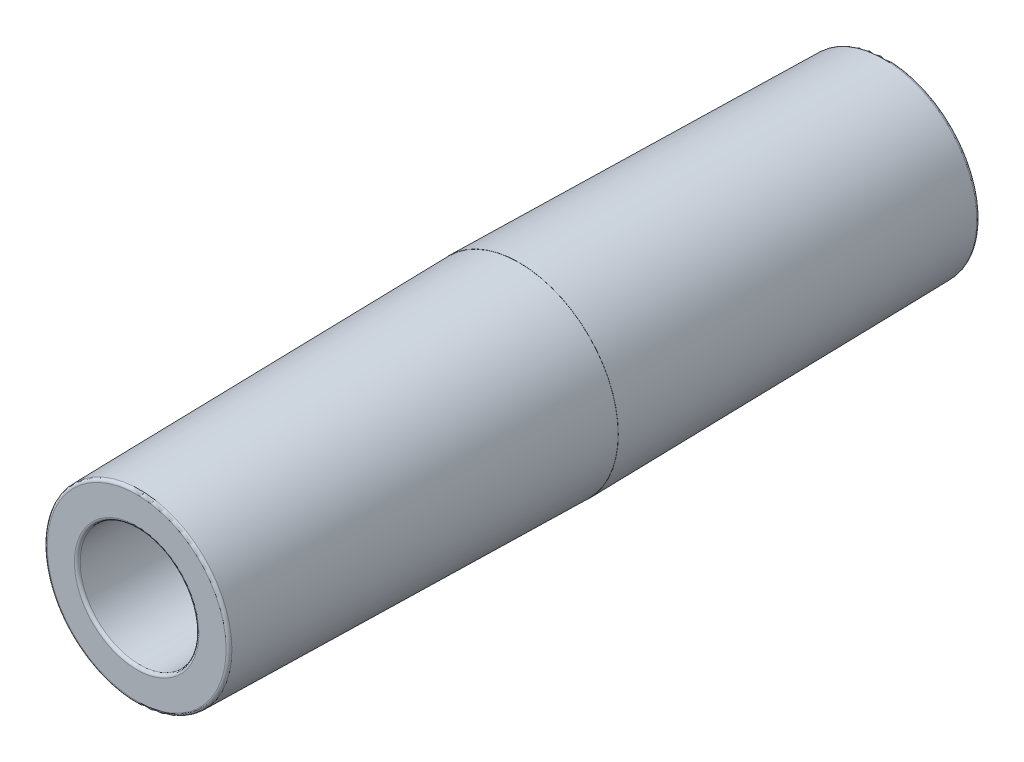
ISO-10303-21;
HEADER;
FILE_DESCRIPTION(('STEP AP214'),'2;1');
FILE_NAME('part.step','',(''),(''),'','','');
FILE_SCHEMA(('AUTOMOTIVE_DESIGN { 1 0 10303 214 1 1 1 1 }'));
ENDSEC;
DATA;
#1=APPLICATION_CONTEXT('core data for automotive mechanical design processes');
#2=APPLICATION_PROTOCOL_DEFINITION('international standard','automotive_design',2000,#1);
#3=PRODUCT_CONTEXT('',#1,'mechanical');
#4=PRODUCT('Part','Part','',(#3));
#5=PRODUCT_RELATED_PRODUCT_CATEGORY('part','',(#4));
#6=PRODUCT_DEFINITION_FORMATION('','',#4);
#7=PRODUCT_DEFINITION_CONTEXT('part definition',#1,'design');
#8=PRODUCT_DEFINITION('design','',#6,#7);
#9=PRODUCT_DEFINITION_SHAPE('','',#8);
#10=(LENGTH_UNIT() NAMED_UNIT(*) SI_UNIT(.MILLI.,.METRE.));
#11=(NAMED_UNIT(*) PLANE_ANGLE_UNIT() SI_UNIT($,.RADIAN.));
#12=(NAMED_UNIT(*) SI_UNIT($,.STERADIAN.) SOLID_ANGLE_UNIT());
#13=UNCERTAINTY_MEASURE_WITH_UNIT(LENGTH_MEASURE(1.E-05),#10,'distance_accuracy_value','');
#14=(GEOMETRIC_REPRESENTATION_CONTEXT(3) GLOBAL_UNCERTAINTY_ASSIGNED_CONTEXT((#13)) GLOBAL_UNIT_ASSIGNED_CONTEXT((#10,
#11,#12)) REPRESENTATION_CONTEXT('',''));
#15=CARTESIAN_POINT('',(0.,0.,0.));
#16=DIRECTION('',(0.,0.,1.));
#17=DIRECTION('',(1.,0.,0.));
#18=AXIS2_PLACEMENT_3D('',#15,#16,#17);
#19=CARTESIAN_POINT('',(8.00560168852926,0.,-31.75));
#20=DIRECTION('',(0.,0.,-1.));
#21=DIRECTION('',(-1.,0.,0.));
#22=AXIS2_PLACEMENT_3D('',#19,#20,#21);
#23=PLANE('',#22);
#24=CARTESIAN_POINT('',(0.,0.,-31.75));
#25=DIRECTION('',(0.,0.,-1.));
#26=DIRECTION('',(-1.,0.,0.));
#27=AXIS2_PLACEMENT_3D('',#24,#25,#26);
#28=CIRCLE('',#27,5.37809124433927);
#29=CARTESIAN_POINT('',(-5.37809124433926,0.,-31.75));
#30=VERTEX_POINT('',#29);
#31=EDGE_CURVE('E56',#30,#30,#28,.F.);
#32=ORIENTED_EDGE('',*,*,#31,.T.);
#33=EDGE_LOOP('',(#32));
#34=FACE_BOUND('',#33,.T.);
#35=CARTESIAN_POINT('',(0.,0.,-31.75));
#36=DIRECTION('',(0.,0.,-1.));
#37=DIRECTION('',(-1.,0.,0.));
#38=AXIS2_PLACEMENT_3D('',#35,#36,#37);
#39=CIRCLE('',#38,7.75599658369768);
#40=CARTESIAN_POINT('',(-7.75599658369767,0.,-31.75));
#41=VERTEX_POINT('',#40);
#42=EDGE_CURVE('E59',#41,#41,#39,.T.);
#43=ORIENTED_EDGE('',*,*,#42,.T.);
#44=EDGE_LOOP('',(#43));
#45=FACE_BOUND('',#44,.T.);
#46=ADVANCED_FACE('F30',(#34,#45),#23,.T.);
#47=CARTESIAN_POINT('',(0.,0.,-31.75));
#48=DIRECTION('',(0.,0.,-1.));
#49=DIRECTION('',(-1.,0.,0.));
#50=AXIS2_PLACEMENT_3D('',#47,#48,#49);
#51=CONICAL_SURFACE('',#50,5.12628077138942,0.00865744578871271);
#52=CARTESIAN_POINT('',(0.,0.,-31.4981989637608));
#53=DIRECTION('',(0.,0.,1.));
#54=DIRECTION('',(1.,0.,0.));
#55=AXIS2_PLACEMENT_3D('',#52,#53,#54);
#56=CIRCLE('',#55,5.1241007631035);
#57=CARTESIAN_POINT('',(5.12410076310351,0.,-31.4981989637608));
#58=VERTEX_POINT('',#57);
#59=EDGE_CURVE('E53',#58,#58,#56,.F.);
#60=ORIENTED_EDGE('',*,*,#59,.T.);
#61=EDGE_LOOP('',(#60));
#62=FACE_BOUND('',#61,.T.);
#63=CARTESIAN_POINT('',(0.,0.,0.));
#64=DIRECTION('',(0.,0.,1.));
#65=DIRECTION('',(1.,0.,0.));
#66=AXIS2_PLACEMENT_3D('',#63,#64,#65);
#67=CIRCLE('',#66,4.85140000000023);
#68=CARTESIAN_POINT('',(4.85140000000024,0.,0.));
#69=VERTEX_POINT('',#68);
#70=EDGE_CURVE('E62',#69,#69,#67,.T.);
#71=ORIENTED_EDGE('',*,*,#70,.T.);
#72=EDGE_LOOP('',(#71));
#73=FACE_BOUND('',#72,.T.);
#74=ADVANCED_FACE('F93',(#62,#73),#51,.F.);
#75=CARTESIAN_POINT('',(4.85140000000024,0.,0.));
#76=DIRECTION('',(0.,0.,-1.));
#77=DIRECTION('',(-1.,0.,0.));
#78=AXIS2_PLACEMENT_3D('',#75,#76,#77);
#79=PLANE('',#78);
#80=CARTESIAN_POINT('',(0.,0.,0.));
#81=DIRECTION('',(0.,0.,1.));
#82=DIRECTION('',(1.,0.,0.));
#83=AXIS2_PLACEMENT_3D('',#80,#81,#82);
#84=CIRCLE('',#83,4.83870000000013);
#85=CARTESIAN_POINT('',(4.83870000000014,0.,0.));
#86=VERTEX_POINT('',#85);
#87=EDGE_CURVE('E65',#86,#86,#84,.T.);
#88=ORIENTED_EDGE('',*,*,#87,.T.);
#89=EDGE_LOOP('',(#88));
#90=FACE_BOUND('',#89,.T.);
#91=ORIENTED_EDGE('',*,*,#70,.F.);
#92=EDGE_LOOP('',(#91));
#93=FACE_BOUND('',#92,.T.);
#94=ADVANCED_FACE('F99',(#90,#93),#79,.T.);
#95=CARTESIAN_POINT('',(0.,0.,0.));
#96=DIRECTION('',(0.,0.,1.));
#97=DIRECTION('',(1.,0.,0.));
#98=AXIS2_PLACEMENT_3D('',#95,#96,#97);
#99=CONICAL_SURFACE('',#98,4.83870000000013,0.00866010734674306);
#100=CARTESIAN_POINT('',(0.,0.,32.7681996401414));
#101=DIRECTION('',(0.,0.,-1.));
#102=DIRECTION('',(-1.,0.,0.));
#103=AXIS2_PLACEMENT_3D('',#100,#101,#102);
#104=CIRCLE('',#103,5.12248322081891);
#105=CARTESIAN_POINT('',(-5.12248322081891,0.,32.7681996401414));
#106=VERTEX_POINT('',#105);
#107=EDGE_CURVE('E45',#106,#106,#104,.F.);
#108=ORIENTED_EDGE('',*,*,#107,.T.);
#109=EDGE_LOOP('',(#108));
#110=FACE_BOUND('',#109,.T.);
#111=ORIENTED_EDGE('',*,*,#87,.F.);
#112=EDGE_LOOP('',(#111));
#113=FACE_BOUND('',#112,.T.);
#114=ADVANCED_FACE('F117',(#110,#113),#99,.F.);
#115=CARTESIAN_POINT('',(5.12466389348369,0.,33.0200000003701));
#116=DIRECTION('',(0.,0.,1.));
#117=DIRECTION('',(1.,0.,0.));
#118=AXIS2_PLACEMENT_3D('',#115,#116,#117);
#119=PLANE('',#118);
#120=CARTESIAN_POINT('',(0.,0.,33.0200000003701));
#121=DIRECTION('',(0.,0.,1.));
#122=DIRECTION('',(1.,0.,0.));
#123=AXIS2_PLACEMENT_3D('',#120,#121,#122);
#124=CIRCLE('',#123,5.37647369620111);
#125=CARTESIAN_POINT('',(5.37647369620112,0.,33.0200000003701));
#126=VERTEX_POINT('',#125);
#127=EDGE_CURVE('E37',#126,#126,#124,.F.);
#128=ORIENTED_EDGE('',*,*,#127,.T.);
#129=EDGE_LOOP('',(#128));
#130=FACE_BOUND('',#129,.T.);
#131=CARTESIAN_POINT('',(0.,0.,33.0200000003701));
#132=DIRECTION('',(0.,0.,1.));
#133=DIRECTION('',(1.,0.,0.));
#134=AXIS2_PLACEMENT_3D('',#131,#132,#133);
#135=CIRCLE('',#134,7.72112865123893);
#136=CARTESIAN_POINT('',(7.72112865123893,0.,33.0200000003701));
#137=VERTEX_POINT('',#136);
#138=EDGE_CURVE('E41',#137,#137,#135,.T.);
#139=ORIENTED_EDGE('',*,*,#138,.T.);
#140=EDGE_LOOP('',(#139));
#141=FACE_BOUND('',#140,.T.);
#142=ADVANCED_FACE('F120',(#130,#141),#119,.T.);
#143=CARTESIAN_POINT('',(0.,0.,33.0200000003701));
#144=DIRECTION('',(0.,0.,-1.));
#145=DIRECTION('',(-1.,0.,0.));
#146=AXIS2_PLACEMENT_3D('',#143,#144,#145);
#147=CONICAL_SURFACE('',#146,7.97073375607054,0.0174532925190175);
#148=CARTESIAN_POINT('',(0.,0.,32.770432911605));
#149=DIRECTION('',(0.,0.,1.));
#150=DIRECTION('',(1.,0.,0.));
#151=AXIS2_PLACEMENT_3D('',#148,#149,#150);
#152=CIRCLE('',#151,7.97508996580865);
#153=CARTESIAN_POINT('',(7.97508996580866,0.,32.770432911605));
#154=VERTEX_POINT('',#153);
#155=EDGE_CURVE('E10',#154,#154,#152,.F.);
#156=ORIENTED_EDGE('',*,*,#155,.T.);
#157=EDGE_LOOP('',(#156));
#158=FACE_BOUND('',#157,.T.);
#159=CARTESIAN_POINT('',(0.,0.,0.));
#160=DIRECTION('',(0.,0.,1.));
#161=DIRECTION('',(1.,0.,0.));
#162=AXIS2_PLACEMENT_3D('',#159,#160,#161);
#163=CIRCLE('',#162,8.54709999997617);
#164=CARTESIAN_POINT('',(8.54709999997618,0.,0.));
#165=VERTEX_POINT('',#164);
#166=EDGE_CURVE('E68',#165,#165,#163,.T.);
#167=ORIENTED_EDGE('',*,*,#166,.T.);
#168=EDGE_LOOP('',(#167));
#169=FACE_BOUND('',#168,.T.);
#170=ADVANCED_FACE('F90',(#158,#169),#147,.T.);
#171=CARTESIAN_POINT('',(8.54709999997618,0.,0.));
#172=DIRECTION('',(0.,0.,1.));
#173=DIRECTION('',(1.,0.,0.));
#174=AXIS2_PLACEMENT_3D('',#171,#172,#173);
#175=PLANE('',#174);
#176=CARTESIAN_POINT('',(0.,0.,0.));
#177=DIRECTION('',(0.,0.,1.));
#178=DIRECTION('',(1.,0.,0.));
#179=AXIS2_PLACEMENT_3D('',#176,#177,#178);
#180=CIRCLE('',#179,8.55979999997627);
#181=CARTESIAN_POINT('',(8.55979999997628,0.,0.));
#182=VERTEX_POINT('',#181);
#183=EDGE_CURVE('E71',#182,#182,#180,.T.);
#184=ORIENTED_EDGE('',*,*,#183,.T.);
#185=EDGE_LOOP('',(#184));
#186=FACE_BOUND('',#185,.T.);
#187=ORIENTED_EDGE('',*,*,#166,.F.);
#188=EDGE_LOOP('',(#187));
#189=FACE_BOUND('',#188,.T.);
#190=ADVANCED_FACE('F75',(#186,#189),#175,.T.);
#191=CARTESIAN_POINT('',(0.,0.,0.));
#192=DIRECTION('',(0.,0.,1.));
#193=DIRECTION('',(1.,0.,0.));
#194=AXIS2_PLACEMENT_3D('',#191,#192,#193);
#195=CONICAL_SURFACE('',#194,8.55979999997627,0.017453292519191);
#196=CARTESIAN_POINT('',(0.,0.,-31.5004329112349));
#197=DIRECTION('',(0.,0.,-1.));
#198=DIRECTION('',(-1.,0.,0.));
#199=AXIS2_PLACEMENT_3D('',#196,#197,#198);
#200=CIRCLE('',#199,8.00995789826741);
#201=CARTESIAN_POINT('',(-8.0099578982674,0.,-31.5004329112349));
#202=VERTEX_POINT('',#201);
#203=EDGE_CURVE('E50',#202,#202,#200,.F.);
#204=ORIENTED_EDGE('',*,*,#203,.T.);
#205=EDGE_LOOP('',(#204));
#206=FACE_BOUND('',#205,.T.);
#207=ORIENTED_EDGE('',*,*,#183,.F.);
#208=EDGE_LOOP('',(#207));
#209=FACE_BOUND('',#208,.T.);
#210=ADVANCED_FACE('F78',(#206,#209),#195,.T.);
#211=CARTESIAN_POINT('',(0.,0.,-31.496));
#212=DIRECTION('',(0.,0.,-1.));
#213=DIRECTION('',(-1.,0.,0.));
#214=AXIS2_PLACEMENT_3D('',#211,#212,#213);
#215=TOROIDAL_SURFACE('',#214,5.37809124433927,0.254);
#216=ORIENTED_EDGE('',*,*,#59,.F.);
#217=EDGE_LOOP('',(#216));
#218=FACE_BOUND('',#217,.T.);
#219=ORIENTED_EDGE('',*,*,#31,.F.);
#220=EDGE_LOOP('',(#219));
#221=FACE_BOUND('',#220,.T.);
#222=ADVANCED_FACE('F80',(#218,#221),#215,.T.);
#223=CARTESIAN_POINT('',(0.,0.,-31.496));
#224=DIRECTION('',(0.,0.,-1.));
#225=DIRECTION('',(-1.,0.,0.));
#226=AXIS2_PLACEMENT_3D('',#223,#224,#225);
#227=TOROIDAL_SURFACE('',#226,7.75599658369768,0.254);
#228=ORIENTED_EDGE('',*,*,#42,.F.);
#229=EDGE_LOOP('',(#228));
#230=FACE_BOUND('',#229,.T.);
#231=ORIENTED_EDGE('',*,*,#203,.F.);
#232=EDGE_LOOP('',(#231));
#233=FACE_BOUND('',#232,.T.);
#234=ADVANCED_FACE('F87',(#230,#233),#227,.T.);
#235=CARTESIAN_POINT('',(0.,0.,32.7660000003701));
#236=DIRECTION('',(0.,0.,1.));
#237=DIRECTION('',(1.,0.,0.));
#238=AXIS2_PLACEMENT_3D('',#235,#236,#237);
#239=TOROIDAL_SURFACE('',#238,5.37647369620111,0.254);
#240=ORIENTED_EDGE('',*,*,#127,.F.);
#241=EDGE_LOOP('',(#240));
#242=FACE_BOUND('',#241,.T.);
#243=ORIENTED_EDGE('',*,*,#107,.F.);
#244=EDGE_LOOP('',(#243));
#245=FACE_BOUND('',#244,.T.);
#246=ADVANCED_FACE('F106',(#242,#245),#239,.T.);
#247=CARTESIAN_POINT('',(0.,0.,32.7660000003701));
#248=DIRECTION('',(0.,0.,1.));
#249=DIRECTION('',(1.,0.,0.));
#250=AXIS2_PLACEMENT_3D('',#247,#248,#249);
#251=TOROIDAL_SURFACE('',#250,7.72112865123893,0.254);
#252=ORIENTED_EDGE('',*,*,#155,.F.);
#253=EDGE_LOOP('',(#252));
#254=FACE_BOUND('',#253,.T.);
#255=ORIENTED_EDGE('',*,*,#138,.F.);
#256=EDGE_LOOP('',(#255));
#257=FACE_BOUND('',#256,.T.);
#258=ADVANCED_FACE('F32',(#254,#257),#251,.T.);
#259=CLOSED_SHELL('',(#46,#74,#94,#114,#142,#170,#190,#210,#222,#234,#246,#258));
#260=MANIFOLD_SOLID_BREP('B2',#259);
#261=ADVANCED_BREP_SHAPE_REPRESENTATION('',(#18,#260),#14);
#262=SHAPE_DEFINITION_REPRESENTATION(#9,#261);
ENDSEC;
END-ISO-10303-21;
